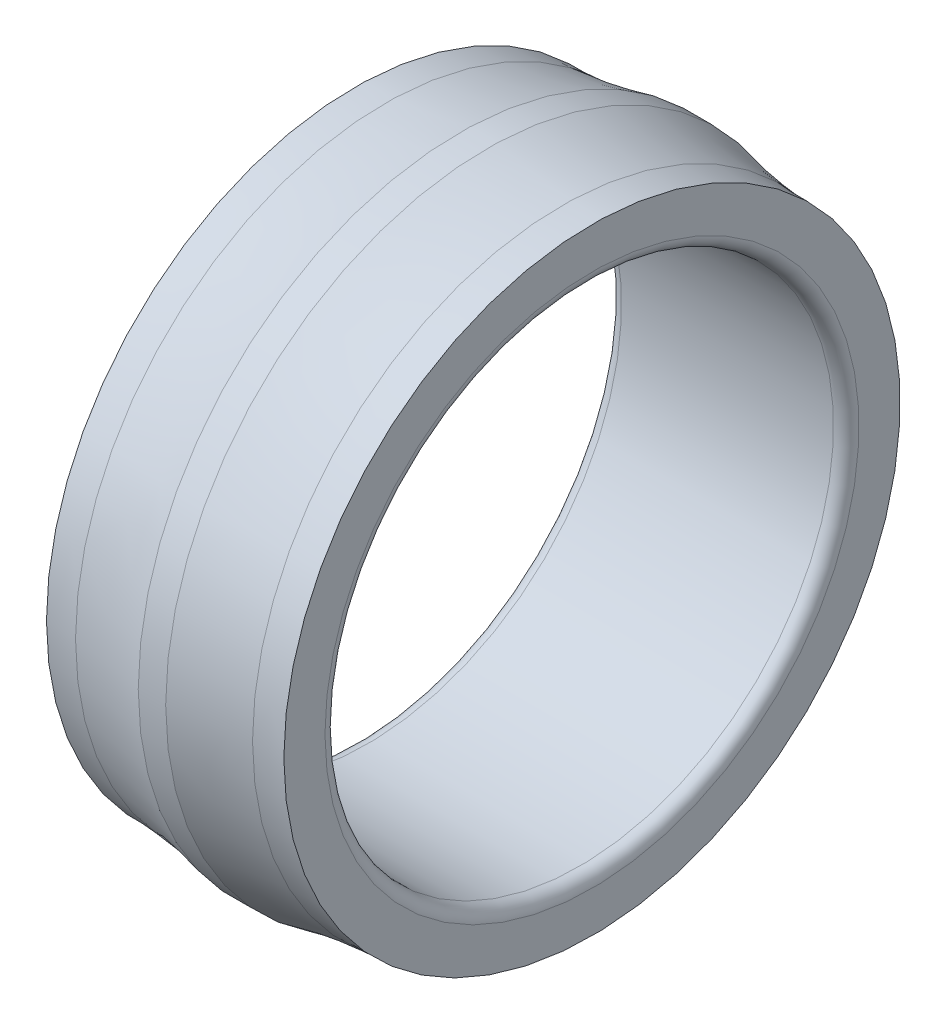
ISO-10303-21;
HEADER;
FILE_DESCRIPTION(('STEP AP214'),'2;1');
FILE_NAME('part.step','',(''),(''),'','','');
FILE_SCHEMA(('AUTOMOTIVE_DESIGN { 1 0 10303 214 1 1 1 1 }'));
ENDSEC;
DATA;
#1=APPLICATION_CONTEXT('core data for automotive mechanical design processes');
#2=APPLICATION_PROTOCOL_DEFINITION('international standard','automotive_design',2000,#1);
#3=PRODUCT_CONTEXT('',#1,'mechanical');
#4=PRODUCT('Part','Part','',(#3));
#5=PRODUCT_RELATED_PRODUCT_CATEGORY('part','',(#4));
#6=PRODUCT_DEFINITION_FORMATION('','',#4);
#7=PRODUCT_DEFINITION_CONTEXT('part definition',#1,'design');
#8=PRODUCT_DEFINITION('design','',#6,#7);
#9=PRODUCT_DEFINITION_SHAPE('','',#8);
#10=(LENGTH_UNIT() NAMED_UNIT(*) SI_UNIT(.MILLI.,.METRE.));
#11=(NAMED_UNIT(*) PLANE_ANGLE_UNIT() SI_UNIT($,.RADIAN.));
#12=(NAMED_UNIT(*) SI_UNIT($,.STERADIAN.) SOLID_ANGLE_UNIT());
#13=UNCERTAINTY_MEASURE_WITH_UNIT(LENGTH_MEASURE(1.E-05),#10,'distance_accuracy_value','');
#14=(GEOMETRIC_REPRESENTATION_CONTEXT(3) GLOBAL_UNCERTAINTY_ASSIGNED_CONTEXT((#13)) GLOBAL_UNIT_ASSIGNED_CONTEXT((#10,
#11,#12)) REPRESENTATION_CONTEXT('',''));
#15=CARTESIAN_POINT('',(0.,0.,0.));
#16=DIRECTION('',(0.,0.,1.));
#17=DIRECTION('',(1.,0.,0.));
#18=AXIS2_PLACEMENT_3D('',#15,#16,#17);
#19=CARTESIAN_POINT('',(1.50000000000004,0.,0.));
#20=DIRECTION('',(-1.,0.,0.));
#21=DIRECTION('',(0.,0.,1.));
#22=AXIS2_PLACEMENT_3D('',#19,#20,#21);
#23=TOROIDAL_SURFACE('',#22,31.5,1.50000000000004);
#24=CARTESIAN_POINT('',(1.5,0.,0.));
#25=DIRECTION('',(-1.,0.,0.));
#26=DIRECTION('',(0.,0.,1.));
#27=AXIS2_PLACEMENT_3D('',#24,#25,#26);
#28=CIRCLE('',#27,30.);
#29=CARTESIAN_POINT('',(1.5,0.,30.));
#30=VERTEX_POINT('',#29);
#31=EDGE_CURVE('E10',#30,#30,#28,.T.);
#32=ORIENTED_EDGE('',*,*,#31,.F.);
#33=EDGE_LOOP('',(#32));
#34=FACE_BOUND('',#33,.T.);
#35=CARTESIAN_POINT('',(0.,0.,0.));
#36=DIRECTION('',(-1.,0.,0.));
#37=DIRECTION('',(0.,0.,1.));
#38=AXIS2_PLACEMENT_3D('',#35,#36,#37);
#39=CIRCLE('',#38,31.5);
#40=CARTESIAN_POINT('',(0.,0.,31.5));
#41=VERTEX_POINT('',#40);
#42=EDGE_CURVE('E62',#41,#41,#39,.T.);
#43=ORIENTED_EDGE('',*,*,#42,.T.);
#44=EDGE_LOOP('',(#43));
#45=FACE_BOUND('',#44,.T.);
#46=ADVANCED_FACE('F28',(#34,#45),#23,.T.);
#47=CARTESIAN_POINT('',(28.,0.,0.));
#48=DIRECTION('',(-1.,0.,0.));
#49=DIRECTION('',(0.,0.,1.));
#50=AXIS2_PLACEMENT_3D('',#47,#48,#49);
#51=CYLINDRICAL_SURFACE('',#50,30.);
#52=CARTESIAN_POINT('',(26.5,0.,0.));
#53=DIRECTION('',(-1.,0.,0.));
#54=DIRECTION('',(0.,0.,1.));
#55=AXIS2_PLACEMENT_3D('',#52,#53,#54);
#56=CIRCLE('',#55,30.);
#57=CARTESIAN_POINT('',(26.5,0.,30.));
#58=VERTEX_POINT('',#57);
#59=EDGE_CURVE('E34',#58,#58,#56,.T.);
#60=ORIENTED_EDGE('',*,*,#59,.F.);
#61=EDGE_LOOP('',(#60));
#62=FACE_BOUND('',#61,.T.);
#63=ORIENTED_EDGE('',*,*,#31,.T.);
#64=EDGE_LOOP('',(#63));
#65=FACE_BOUND('',#64,.T.);
#66=ADVANCED_FACE('F111',(#62,#65),#51,.F.);
#67=CARTESIAN_POINT('',(26.4999999999999,0.,0.));
#68=DIRECTION('',(-1.,0.,0.));
#69=DIRECTION('',(0.,0.,1.));
#70=AXIS2_PLACEMENT_3D('',#67,#68,#69);
#71=TOROIDAL_SURFACE('',#70,31.5000000000001,1.50000000000008);
#72=CARTESIAN_POINT('',(28.,0.,0.));
#73=DIRECTION('',(-1.,0.,0.));
#74=DIRECTION('',(0.,0.,1.));
#75=AXIS2_PLACEMENT_3D('',#72,#73,#74);
#76=CIRCLE('',#75,31.5);
#77=CARTESIAN_POINT('',(28.,0.,31.5));
#78=VERTEX_POINT('',#77);
#79=EDGE_CURVE('E38',#78,#78,#76,.T.);
#80=ORIENTED_EDGE('',*,*,#79,.F.);
#81=EDGE_LOOP('',(#80));
#82=FACE_BOUND('',#81,.T.);
#83=ORIENTED_EDGE('',*,*,#59,.T.);
#84=EDGE_LOOP('',(#83));
#85=FACE_BOUND('',#84,.T.);
#86=ADVANCED_FACE('F106',(#82,#85),#71,.T.);
#87=CARTESIAN_POINT('',(28.,31.5,0.));
#88=DIRECTION('',(-1.,0.,0.));
#89=DIRECTION('',(0.,0.,1.));
#90=AXIS2_PLACEMENT_3D('',#87,#88,#89);
#91=PLANE('',#90);
#92=CARTESIAN_POINT('',(28.,0.,0.));
#93=DIRECTION('',(-1.,0.,0.));
#94=DIRECTION('',(0.,0.,1.));
#95=AXIS2_PLACEMENT_3D('',#92,#93,#94);
#96=CIRCLE('',#95,36.35);
#97=CARTESIAN_POINT('',(28.,0.,36.35));
#98=VERTEX_POINT('',#97);
#99=EDGE_CURVE('E42',#98,#98,#96,.T.);
#100=ORIENTED_EDGE('',*,*,#99,.F.);
#101=EDGE_LOOP('',(#100));
#102=FACE_BOUND('',#101,.T.);
#103=ORIENTED_EDGE('',*,*,#79,.T.);
#104=EDGE_LOOP('',(#103));
#105=FACE_BOUND('',#104,.T.);
#106=ADVANCED_FACE('F100',(#102,#105),#91,.F.);
#107=CARTESIAN_POINT('',(27.2712270351134,0.,0.));
#108=DIRECTION('',(-1.,0.,0.));
#109=DIRECTION('',(0.,0.,1.));
#110=AXIS2_PLACEMENT_3D('',#107,#108,#109);
#111=TOROIDAL_SURFACE('',#110,64.3405142854659,27.9999999999861);
#112=CARTESIAN_POINT('',(24.4391510018259,0.,0.));
#113=DIRECTION('',(-1.,0.,0.));
#114=DIRECTION('',(0.,0.,1.));
#115=AXIS2_PLACEMENT_3D('',#112,#113,#114);
#116=CIRCLE('',#115,36.48410846309);
#117=CARTESIAN_POINT('',(24.4391510018259,0.,36.48410846309));
#118=VERTEX_POINT('',#117);
#119=EDGE_CURVE('E47',#118,#118,#116,.T.);
#120=ORIENTED_EDGE('',*,*,#119,.F.);
#121=EDGE_LOOP('',(#120));
#122=FACE_BOUND('',#121,.T.);
#123=ORIENTED_EDGE('',*,*,#99,.T.);
#124=EDGE_LOOP('',(#123));
#125=FACE_BOUND('',#124,.T.);
#126=ADVANCED_FACE('F94',(#122,#125),#111,.F.);
#127=CARTESIAN_POINT('',(27.8846304313696,0.,0.));
#128=DIRECTION('',(-1.,0.,0.));
#129=DIRECTION('',(0.,0.,1.));
#130=AXIS2_PLACEMENT_3D('',#127,#128,#129);
#131=TOROIDAL_SURFACE('',#130,85.8800893471827,49.5160000000107);
#132=CARTESIAN_POINT('',(15.6179238528266,0.,0.));
#133=DIRECTION('',(-1.,0.,0.));
#134=DIRECTION('',(0.,0.,1.));
#135=AXIS2_PLACEMENT_3D('',#132,#133,#134);
#136=CIRCLE('',#135,37.9075746568208);
#137=CARTESIAN_POINT('',(15.6179238528266,0.,37.9075746568208));
#138=VERTEX_POINT('',#137);
#139=EDGE_CURVE('E50',#138,#138,#136,.T.);
#140=ORIENTED_EDGE('',*,*,#139,.F.);
#141=EDGE_LOOP('',(#140));
#142=FACE_BOUND('',#141,.T.);
#143=ORIENTED_EDGE('',*,*,#119,.T.);
#144=EDGE_LOOP('',(#143));
#145=FACE_BOUND('',#144,.T.);
#146=ADVANCED_FACE('F88',(#142,#145),#131,.F.);
#147=CARTESIAN_POINT('',(28.,0.,0.));
#148=DIRECTION('',(-1.,0.,0.));
#149=DIRECTION('',(0.,0.,1.));
#150=AXIS2_PLACEMENT_3D('',#147,#148,#149);
#151=CYLINDRICAL_SURFACE('',#150,37.9075746568208);
#152=CARTESIAN_POINT('',(12.3820761471734,0.,0.));
#153=DIRECTION('',(-1.,0.,0.));
#154=DIRECTION('',(0.,0.,1.));
#155=AXIS2_PLACEMENT_3D('',#152,#153,#154);
#156=CIRCLE('',#155,37.9075746568208);
#157=CARTESIAN_POINT('',(12.3820761471734,0.,37.9075746568208));
#158=VERTEX_POINT('',#157);
#159=EDGE_CURVE('E53',#158,#158,#156,.T.);
#160=ORIENTED_EDGE('',*,*,#159,.F.);
#161=EDGE_LOOP('',(#160));
#162=FACE_BOUND('',#161,.T.);
#163=ORIENTED_EDGE('',*,*,#139,.T.);
#164=EDGE_LOOP('',(#163));
#165=FACE_BOUND('',#164,.T.);
#166=ADVANCED_FACE('F82',(#162,#165),#151,.T.);
#167=CARTESIAN_POINT('',(0.115369568629176,0.,0.));
#168=DIRECTION('',(-1.,0.,0.));
#169=DIRECTION('',(0.,0.,1.));
#170=AXIS2_PLACEMENT_3D('',#167,#168,#169);
#171=TOROIDAL_SURFACE('',#170,85.8800893471877,49.5160000000158);
#172=CARTESIAN_POINT('',(3.56084899817431,0.,0.));
#173=DIRECTION('',(-1.,0.,0.));
#174=DIRECTION('',(0.,0.,1.));
#175=AXIS2_PLACEMENT_3D('',#172,#173,#174);
#176=CIRCLE('',#175,36.48410846309);
#177=CARTESIAN_POINT('',(3.56084899817431,0.,36.48410846309));
#178=VERTEX_POINT('',#177);
#179=EDGE_CURVE('E56',#178,#178,#176,.T.);
#180=ORIENTED_EDGE('',*,*,#179,.F.);
#181=EDGE_LOOP('',(#180));
#182=FACE_BOUND('',#181,.T.);
#183=ORIENTED_EDGE('',*,*,#159,.T.);
#184=EDGE_LOOP('',(#183));
#185=FACE_BOUND('',#184,.T.);
#186=ADVANCED_FACE('F76',(#182,#185),#171,.F.);
#187=CARTESIAN_POINT('',(0.72877296488642,0.,0.));
#188=DIRECTION('',(-1.,0.,0.));
#189=DIRECTION('',(0.,0.,1.));
#190=AXIS2_PLACEMENT_3D('',#187,#188,#189);
#191=TOROIDAL_SURFACE('',#190,64.3405142854687,27.9999999999889);
#192=CARTESIAN_POINT('',(0.,0.,0.));
#193=DIRECTION('',(-1.,0.,0.));
#194=DIRECTION('',(0.,0.,1.));
#195=AXIS2_PLACEMENT_3D('',#192,#193,#194);
#196=CIRCLE('',#195,36.35);
#197=CARTESIAN_POINT('',(0.,0.,36.35));
#198=VERTEX_POINT('',#197);
#199=EDGE_CURVE('E59',#198,#198,#196,.T.);
#200=ORIENTED_EDGE('',*,*,#199,.F.);
#201=EDGE_LOOP('',(#200));
#202=FACE_BOUND('',#201,.T.);
#203=ORIENTED_EDGE('',*,*,#179,.T.);
#204=EDGE_LOOP('',(#203));
#205=FACE_BOUND('',#204,.T.);
#206=ADVANCED_FACE('F70',(#202,#205),#191,.F.);
#207=CARTESIAN_POINT('',(0.,36.35,0.));
#208=DIRECTION('',(1.,0.,0.));
#209=DIRECTION('',(0.,0.,-1.));
#210=AXIS2_PLACEMENT_3D('',#207,#208,#209);
#211=PLANE('',#210);
#212=ORIENTED_EDGE('',*,*,#42,.F.);
#213=EDGE_LOOP('',(#212));
#214=FACE_BOUND('',#213,.T.);
#215=ORIENTED_EDGE('',*,*,#199,.T.);
#216=EDGE_LOOP('',(#215));
#217=FACE_BOUND('',#216,.T.);
#218=ADVANCED_FACE('F67',(#214,#217),#211,.F.);
#219=CLOSED_SHELL('',(#46,#66,#86,#106,#126,#146,#166,#186,#206,#218));
#220=MANIFOLD_SOLID_BREP('B2',#219);
#221=ADVANCED_BREP_SHAPE_REPRESENTATION('',(#18,#220),#14);
#222=SHAPE_DEFINITION_REPRESENTATION(#9,#221);
ENDSEC;
END-ISO-10303-21;
